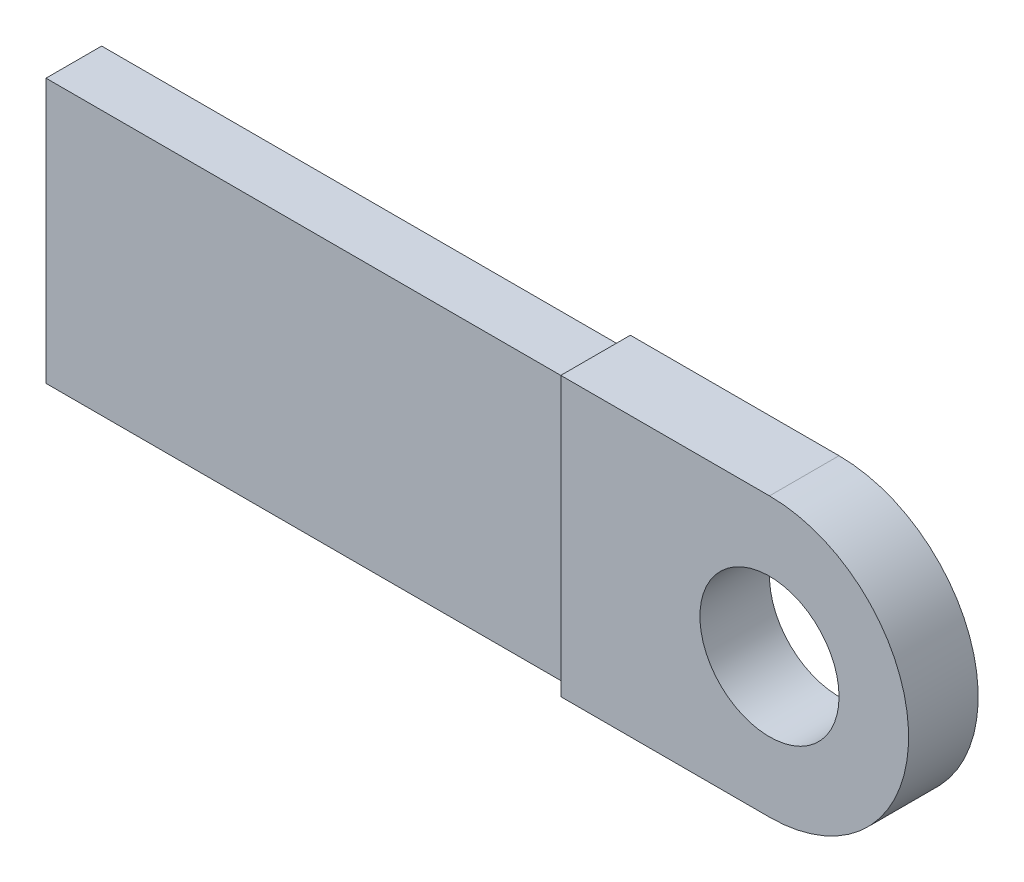
ISO-10303-21;
HEADER;
FILE_DESCRIPTION(('STEP AP214'),'2;1');
FILE_NAME('part.step','',(''),(''),'','','');
FILE_SCHEMA(('AUTOMOTIVE_DESIGN { 1 0 10303 214 1 1 1 1 }'));
ENDSEC;
DATA;
#1=APPLICATION_CONTEXT('core data for automotive mechanical design processes');
#2=APPLICATION_PROTOCOL_DEFINITION('international standard','automotive_design',2000,#1);
#3=PRODUCT_CONTEXT('',#1,'mechanical');
#4=PRODUCT('Part','Part','',(#3));
#5=PRODUCT_RELATED_PRODUCT_CATEGORY('part','',(#4));
#6=PRODUCT_DEFINITION_FORMATION('','',#4);
#7=PRODUCT_DEFINITION_CONTEXT('part definition',#1,'design');
#8=PRODUCT_DEFINITION('design','',#6,#7);
#9=PRODUCT_DEFINITION_SHAPE('','',#8);
#10=(LENGTH_UNIT() NAMED_UNIT(*) SI_UNIT(.MILLI.,.METRE.));
#11=(NAMED_UNIT(*) PLANE_ANGLE_UNIT() SI_UNIT($,.RADIAN.));
#12=(NAMED_UNIT(*) SI_UNIT($,.STERADIAN.) SOLID_ANGLE_UNIT());
#13=UNCERTAINTY_MEASURE_WITH_UNIT(LENGTH_MEASURE(1.E-05),#10,'distance_accuracy_value','');
#14=(GEOMETRIC_REPRESENTATION_CONTEXT(3) GLOBAL_UNCERTAINTY_ASSIGNED_CONTEXT((#13)) GLOBAL_UNIT_ASSIGNED_CONTEXT((#10,
#11,#12)) REPRESENTATION_CONTEXT('',''));
#15=CARTESIAN_POINT('',(0.,0.,0.));
#16=DIRECTION('',(0.,0.,1.));
#17=DIRECTION('',(1.,0.,0.));
#18=AXIS2_PLACEMENT_3D('',#15,#16,#17);
#19=CARTESIAN_POINT('',(0.,0.,20.));
#20=DIRECTION('',(-1.,0.,0.));
#21=DIRECTION('',(0.,0.,1.));
#22=AXIS2_PLACEMENT_3D('',#19,#20,#21);
#23=PLANE('',#22);
#24=DIRECTION('',(0.,1.,0.));
#25=VECTOR('',#24,1.);
#26=CARTESIAN_POINT('',(0.,0.,0.));
#27=LINE('',#26,#25);
#28=CARTESIAN_POINT('',(0.,0.,0.));
#29=VERTEX_POINT('',#28);
#30=CARTESIAN_POINT('',(0.,80.,0.));
#31=VERTEX_POINT('',#30);
#32=EDGE_CURVE('E157',#29,#31,#27,.T.);
#33=ORIENTED_EDGE('',*,*,#32,.F.);
#34=DIRECTION('',(0.,0.,-1.));
#35=VECTOR('',#34,1.);
#36=CARTESIAN_POINT('',(0.,0.,20.));
#37=LINE('',#36,#35);
#38=CARTESIAN_POINT('',(0.,0.,20.));
#39=VERTEX_POINT('',#38);
#40=EDGE_CURVE('E162',#39,#29,#37,.T.);
#41=ORIENTED_EDGE('',*,*,#40,.F.);
#42=DIRECTION('',(0.,1.,0.));
#43=VECTOR('',#42,1.);
#44=CARTESIAN_POINT('',(0.,0.,20.));
#45=LINE('',#44,#43);
#46=CARTESIAN_POINT('',(0.,80.,20.));
#47=VERTEX_POINT('',#46);
#48=EDGE_CURVE('E148',#39,#47,#45,.T.);
#49=ORIENTED_EDGE('',*,*,#48,.T.);
#50=DIRECTION('',(0.,0.,-1.));
#51=VECTOR('',#50,1.);
#52=CARTESIAN_POINT('',(0.,80.,20.));
#53=LINE('',#52,#51);
#54=EDGE_CURVE('E43',#47,#31,#53,.T.);
#55=ORIENTED_EDGE('',*,*,#54,.T.);
#56=EDGE_LOOP('',(#33,#41,#49,#55));
#57=FACE_BOUND('',#56,.T.);
#58=DIRECTION('',(0.,-1.,0.));
#59=VECTOR('',#58,1.);
#60=CARTESIAN_POINT('',(0.,78.,2.));
#61=LINE('',#60,#59);
#62=CARTESIAN_POINT('',(0.,78.,2.));
#63=VERTEX_POINT('',#62);
#64=CARTESIAN_POINT('',(0.,2.,2.));
#65=VERTEX_POINT('',#64);
#66=EDGE_CURVE('E283',#63,#65,#61,.T.);
#67=ORIENTED_EDGE('',*,*,#66,.F.);
#68=DIRECTION('',(0.,0.,-1.));
#69=VECTOR('',#68,1.);
#70=CARTESIAN_POINT('',(0.,78.,18.));
#71=LINE('',#70,#69);
#72=CARTESIAN_POINT('',(0.,78.,18.));
#73=VERTEX_POINT('',#72);
#74=EDGE_CURVE('E129',#73,#63,#71,.T.);
#75=ORIENTED_EDGE('',*,*,#74,.F.);
#76=DIRECTION('',(0.,1.,0.));
#77=VECTOR('',#76,1.);
#78=CARTESIAN_POINT('',(0.,2.,18.));
#79=LINE('',#78,#77);
#80=CARTESIAN_POINT('',(0.,2.,18.));
#81=VERTEX_POINT('',#80);
#82=EDGE_CURVE('E125',#81,#73,#79,.T.);
#83=ORIENTED_EDGE('',*,*,#82,.F.);
#84=DIRECTION('',(0.,0.,1.));
#85=VECTOR('',#84,1.);
#86=CARTESIAN_POINT('',(0.,2.,2.));
#87=LINE('',#86,#85);
#88=EDGE_CURVE('E280',#65,#81,#87,.T.);
#89=ORIENTED_EDGE('',*,*,#88,.F.);
#90=EDGE_LOOP('',(#67,#75,#83,#89));
#91=FACE_BOUND('',#90,.T.);
#92=ADVANCED_FACE('F35',(#57,#91),#23,.T.);
#93=CARTESIAN_POINT('',(60.,40.,20.));
#94=DIRECTION('',(0.,0.,-1.));
#95=DIRECTION('',(-1.,0.,0.));
#96=AXIS2_PLACEMENT_3D('',#93,#94,#95);
#97=CYLINDRICAL_SURFACE('',#96,40.);
#98=CARTESIAN_POINT('',(60.,40.,0.));
#99=DIRECTION('',(0.,0.,1.));
#100=DIRECTION('',(1.,0.,0.));
#101=AXIS2_PLACEMENT_3D('',#98,#99,#100);
#102=CIRCLE('',#101,40.);
#103=CARTESIAN_POINT('',(60.,80.,0.));
#104=VERTEX_POINT('',#103);
#105=CARTESIAN_POINT('',(60.,0.,0.));
#106=VERTEX_POINT('',#105);
#107=EDGE_CURVE('E140',#104,#106,#102,.F.);
#108=ORIENTED_EDGE('',*,*,#107,.F.);
#109=DIRECTION('',(0.,0.,-1.));
#110=VECTOR('',#109,1.);
#111=CARTESIAN_POINT('',(60.,80.,20.));
#112=LINE('',#111,#110);
#113=CARTESIAN_POINT('',(60.,80.,20.));
#114=VERTEX_POINT('',#113);
#115=EDGE_CURVE('E11',#114,#104,#112,.T.);
#116=ORIENTED_EDGE('',*,*,#115,.F.);
#117=CARTESIAN_POINT('',(60.,40.,20.));
#118=DIRECTION('',(0.,0.,1.));
#119=DIRECTION('',(1.,0.,0.));
#120=AXIS2_PLACEMENT_3D('',#117,#118,#119);
#121=CIRCLE('',#120,40.);
#122=CARTESIAN_POINT('',(60.,0.,20.));
#123=VERTEX_POINT('',#122);
#124=EDGE_CURVE('E142',#114,#123,#121,.F.);
#125=ORIENTED_EDGE('',*,*,#124,.T.);
#126=DIRECTION('',(0.,0.,-1.));
#127=VECTOR('',#126,1.);
#128=CARTESIAN_POINT('',(60.,0.,20.));
#129=LINE('',#128,#127);
#130=EDGE_CURVE('E80',#123,#106,#129,.T.);
#131=ORIENTED_EDGE('',*,*,#130,.T.);
#132=EDGE_LOOP('',(#108,#116,#125,#131));
#133=FACE_BOUND('',#132,.T.);
#134=ADVANCED_FACE('F37',(#133),#97,.T.);
#135=CARTESIAN_POINT('',(0.,80.,20.));
#136=DIRECTION('',(0.,1.,0.));
#137=DIRECTION('',(0.,0.,1.));
#138=AXIS2_PLACEMENT_3D('',#135,#136,#137);
#139=PLANE('',#138);
#140=DIRECTION('',(1.,0.,0.));
#141=VECTOR('',#140,1.);
#142=CARTESIAN_POINT('',(0.,80.,0.));
#143=LINE('',#142,#141);
#144=EDGE_CURVE('E154',#31,#104,#143,.T.);
#145=ORIENTED_EDGE('',*,*,#144,.F.);
#146=ORIENTED_EDGE('',*,*,#54,.F.);
#147=DIRECTION('',(1.,0.,0.));
#148=VECTOR('',#147,1.);
#149=CARTESIAN_POINT('',(0.,80.,20.));
#150=LINE('',#149,#148);
#151=EDGE_CURVE('E144',#47,#114,#150,.T.);
#152=ORIENTED_EDGE('',*,*,#151,.T.);
#153=ORIENTED_EDGE('',*,*,#115,.T.);
#154=EDGE_LOOP('',(#145,#146,#152,#153));
#155=FACE_BOUND('',#154,.T.);
#156=ADVANCED_FACE('F169',(#155),#139,.T.);
#157=CARTESIAN_POINT('',(0.,0.,20.));
#158=DIRECTION('',(0.,1.,0.));
#159=DIRECTION('',(0.,0.,1.));
#160=AXIS2_PLACEMENT_3D('',#157,#158,#159);
#161=PLANE('',#160);
#162=DIRECTION('',(1.,0.,0.));
#163=VECTOR('',#162,1.);
#164=CARTESIAN_POINT('',(0.,0.,0.));
#165=LINE('',#164,#163);
#166=EDGE_CURVE('E145',#29,#106,#165,.T.);
#167=ORIENTED_EDGE('',*,*,#166,.T.);
#168=ORIENTED_EDGE('',*,*,#130,.F.);
#169=DIRECTION('',(1.,0.,0.));
#170=VECTOR('',#169,1.);
#171=CARTESIAN_POINT('',(0.,0.,20.));
#172=LINE('',#171,#170);
#173=EDGE_CURVE('E59',#39,#123,#172,.T.);
#174=ORIENTED_EDGE('',*,*,#173,.F.);
#175=ORIENTED_EDGE('',*,*,#40,.T.);
#176=EDGE_LOOP('',(#167,#168,#174,#175));
#177=FACE_BOUND('',#176,.T.);
#178=ADVANCED_FACE('F174',(#177),#161,.F.);
#179=CARTESIAN_POINT('',(0.,0.,20.));
#180=DIRECTION('',(0.,0.,1.));
#181=DIRECTION('',(1.,0.,0.));
#182=AXIS2_PLACEMENT_3D('',#179,#180,#181);
#183=PLANE('',#182);
#184=CARTESIAN_POINT('',(60.,40.,20.));
#185=DIRECTION('',(0.,0.,1.));
#186=DIRECTION('',(1.,0.,0.));
#187=AXIS2_PLACEMENT_3D('',#184,#185,#186);
#188=CIRCLE('',#187,20.);
#189=CARTESIAN_POINT('',(80.,40.,20.));
#190=VERTEX_POINT('',#189);
#191=EDGE_CURVE('E131',#190,#190,#188,.T.);
#192=ORIENTED_EDGE('',*,*,#191,.F.);
#193=EDGE_LOOP('',(#192));
#194=FACE_BOUND('',#193,.T.);
#195=ORIENTED_EDGE('',*,*,#124,.F.);
#196=ORIENTED_EDGE('',*,*,#151,.F.);
#197=ORIENTED_EDGE('',*,*,#48,.F.);
#198=ORIENTED_EDGE('',*,*,#173,.T.);
#199=EDGE_LOOP('',(#195,#196,#197,#198));
#200=FACE_BOUND('',#199,.T.);
#201=ADVANCED_FACE('F175',(#194,#200),#183,.T.);
#202=CARTESIAN_POINT('',(0.,0.,0.));
#203=DIRECTION('',(0.,0.,1.));
#204=DIRECTION('',(1.,0.,0.));
#205=AXIS2_PLACEMENT_3D('',#202,#203,#204);
#206=PLANE('',#205);
#207=CARTESIAN_POINT('',(60.,40.,0.));
#208=DIRECTION('',(0.,0.,1.));
#209=DIRECTION('',(1.,0.,0.));
#210=AXIS2_PLACEMENT_3D('',#207,#208,#209);
#211=CIRCLE('',#210,20.);
#212=CARTESIAN_POINT('',(80.,40.,0.));
#213=VERTEX_POINT('',#212);
#214=EDGE_CURVE('E134',#213,#213,#211,.T.);
#215=ORIENTED_EDGE('',*,*,#214,.T.);
#216=EDGE_LOOP('',(#215));
#217=FACE_BOUND('',#216,.T.);
#218=ORIENTED_EDGE('',*,*,#107,.T.);
#219=ORIENTED_EDGE('',*,*,#166,.F.);
#220=ORIENTED_EDGE('',*,*,#32,.T.);
#221=ORIENTED_EDGE('',*,*,#144,.T.);
#222=EDGE_LOOP('',(#218,#219,#220,#221));
#223=FACE_BOUND('',#222,.T.);
#224=ADVANCED_FACE('F172',(#217,#223),#206,.F.);
#225=CARTESIAN_POINT('',(60.,40.,0.));
#226=DIRECTION('',(0.,0.,1.));
#227=DIRECTION('',(1.,0.,0.));
#228=AXIS2_PLACEMENT_3D('',#225,#226,#227);
#229=CYLINDRICAL_SURFACE('',#228,20.);
#230=ORIENTED_EDGE('',*,*,#214,.F.);
#231=EDGE_LOOP('',(#230));
#232=FACE_BOUND('',#231,.T.);
#233=ORIENTED_EDGE('',*,*,#191,.T.);
#234=EDGE_LOOP('',(#233));
#235=FACE_BOUND('',#234,.T.);
#236=ADVANCED_FACE('F189',(#232,#235),#229,.F.);
#237=CARTESIAN_POINT('',(-150.,78.,18.));
#238=DIRECTION('',(0.,-1.,0.));
#239=DIRECTION('',(0.,0.,-1.));
#240=AXIS2_PLACEMENT_3D('',#237,#238,#239);
#241=PLANE('',#240);
#242=ORIENTED_EDGE('',*,*,#74,.T.);
#243=DIRECTION('',(1.,0.,0.));
#244=VECTOR('',#243,1.);
#245=CARTESIAN_POINT('',(-150.,78.,2.));
#246=LINE('',#245,#244);
#247=CARTESIAN_POINT('',(-150.,78.,2.));
#248=VERTEX_POINT('',#247);
#249=EDGE_CURVE('E110',#248,#63,#246,.T.);
#250=ORIENTED_EDGE('',*,*,#249,.F.);
#251=DIRECTION('',(0.,0.,-1.));
#252=VECTOR('',#251,1.);
#253=CARTESIAN_POINT('',(-150.,78.,18.));
#254=LINE('',#253,#252);
#255=CARTESIAN_POINT('',(-150.,78.,18.));
#256=VERTEX_POINT('',#255);
#257=EDGE_CURVE('E117',#256,#248,#254,.T.);
#258=ORIENTED_EDGE('',*,*,#257,.F.);
#259=DIRECTION('',(1.,0.,0.));
#260=VECTOR('',#259,1.);
#261=CARTESIAN_POINT('',(-150.,78.,18.));
#262=LINE('',#261,#260);
#263=EDGE_CURVE('E278',#256,#73,#262,.T.);
#264=ORIENTED_EDGE('',*,*,#263,.T.);
#265=EDGE_LOOP('',(#242,#250,#258,#264));
#266=FACE_BOUND('',#265,.T.);
#267=ADVANCED_FACE('F127',(#266),#241,.F.);
#268=CARTESIAN_POINT('',(-150.,78.,2.));
#269=DIRECTION('',(0.,0.,1.));
#270=DIRECTION('',(1.,0.,0.));
#271=AXIS2_PLACEMENT_3D('',#268,#269,#270);
#272=PLANE('',#271);
#273=ORIENTED_EDGE('',*,*,#66,.T.);
#274=DIRECTION('',(1.,0.,0.));
#275=VECTOR('',#274,1.);
#276=CARTESIAN_POINT('',(-150.,2.,2.));
#277=LINE('',#276,#275);
#278=CARTESIAN_POINT('',(-150.,2.,2.));
#279=VERTEX_POINT('',#278);
#280=EDGE_CURVE('E113',#279,#65,#277,.T.);
#281=ORIENTED_EDGE('',*,*,#280,.F.);
#282=DIRECTION('',(0.,-1.,0.));
#283=VECTOR('',#282,1.);
#284=CARTESIAN_POINT('',(-150.,78.,2.));
#285=LINE('',#284,#283);
#286=EDGE_CURVE('E106',#248,#279,#285,.T.);
#287=ORIENTED_EDGE('',*,*,#286,.F.);
#288=ORIENTED_EDGE('',*,*,#249,.T.);
#289=EDGE_LOOP('',(#273,#281,#287,#288));
#290=FACE_BOUND('',#289,.T.);
#291=ADVANCED_FACE('F108',(#290),#272,.F.);
#292=CARTESIAN_POINT('',(-150.,2.,2.));
#293=DIRECTION('',(0.,1.,0.));
#294=DIRECTION('',(0.,0.,1.));
#295=AXIS2_PLACEMENT_3D('',#292,#293,#294);
#296=PLANE('',#295);
#297=ORIENTED_EDGE('',*,*,#88,.T.);
#298=DIRECTION('',(1.,0.,0.));
#299=VECTOR('',#298,1.);
#300=CARTESIAN_POINT('',(-150.,2.,18.));
#301=LINE('',#300,#299);
#302=CARTESIAN_POINT('',(-150.,2.,18.));
#303=VERTEX_POINT('',#302);
#304=EDGE_CURVE('E50',#303,#81,#301,.T.);
#305=ORIENTED_EDGE('',*,*,#304,.F.);
#306=DIRECTION('',(0.,0.,1.));
#307=VECTOR('',#306,1.);
#308=CARTESIAN_POINT('',(-150.,2.,2.));
#309=LINE('',#308,#307);
#310=EDGE_CURVE('E116',#279,#303,#309,.T.);
#311=ORIENTED_EDGE('',*,*,#310,.F.);
#312=ORIENTED_EDGE('',*,*,#280,.T.);
#313=EDGE_LOOP('',(#297,#305,#311,#312));
#314=FACE_BOUND('',#313,.T.);
#315=ADVANCED_FACE('F201',(#314),#296,.F.);
#316=CARTESIAN_POINT('',(-150.,2.,18.));
#317=DIRECTION('',(0.,0.,-1.));
#318=DIRECTION('',(-1.,0.,0.));
#319=AXIS2_PLACEMENT_3D('',#316,#317,#318);
#320=PLANE('',#319);
#321=ORIENTED_EDGE('',*,*,#82,.T.);
#322=ORIENTED_EDGE('',*,*,#263,.F.);
#323=DIRECTION('',(0.,1.,0.));
#324=VECTOR('',#323,1.);
#325=CARTESIAN_POINT('',(-150.,2.,18.));
#326=LINE('',#325,#324);
#327=EDGE_CURVE('E121',#303,#256,#326,.T.);
#328=ORIENTED_EDGE('',*,*,#327,.F.);
#329=ORIENTED_EDGE('',*,*,#304,.T.);
#330=EDGE_LOOP('',(#321,#322,#328,#329));
#331=FACE_BOUND('',#330,.T.);
#332=ADVANCED_FACE('F204',(#331),#320,.F.);
#333=CARTESIAN_POINT('',(-150.,0.,0.));
#334=DIRECTION('',(-1.,0.,0.));
#335=DIRECTION('',(0.,0.,1.));
#336=AXIS2_PLACEMENT_3D('',#333,#334,#335);
#337=PLANE('',#336);
#338=ORIENTED_EDGE('',*,*,#257,.T.);
#339=ORIENTED_EDGE('',*,*,#286,.T.);
#340=ORIENTED_EDGE('',*,*,#310,.T.);
#341=ORIENTED_EDGE('',*,*,#327,.T.);
#342=EDGE_LOOP('',(#338,#339,#340,#341));
#343=FACE_BOUND('',#342,.T.);
#344=ADVANCED_FACE('F120',(#343),#337,.T.);
#345=CLOSED_SHELL('',(#92,#134,#156,#178,#201,#224,#236,#267,#291,#315,#332,#344));
#346=MANIFOLD_SOLID_BREP('B2',#345);
#347=ADVANCED_BREP_SHAPE_REPRESENTATION('',(#18,#346),#14);
#348=SHAPE_DEFINITION_REPRESENTATION(#9,#347);
ENDSEC;
END-ISO-10303-21;
